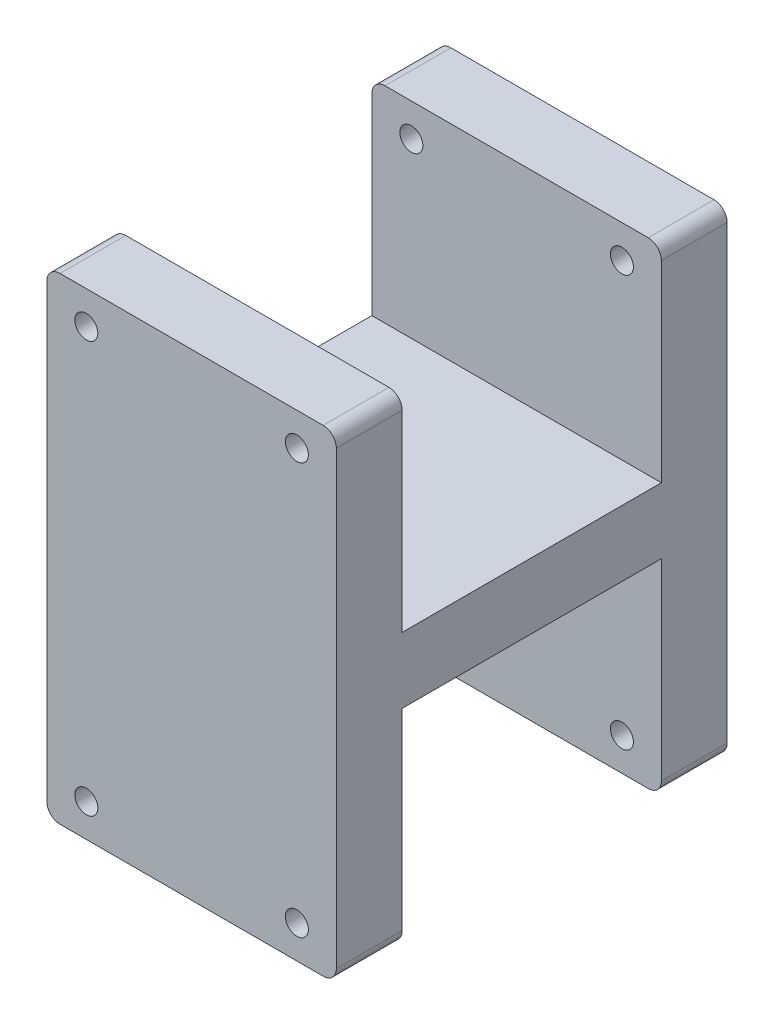
ISO-10303-21;
HEADER;
FILE_DESCRIPTION(('STEP AP214'),'2;1');
FILE_NAME('part.step','',(''),(''),'','','');
FILE_SCHEMA(('AUTOMOTIVE_DESIGN { 1 0 10303 214 1 1 1 1 }'));
ENDSEC;
DATA;
#1=APPLICATION_CONTEXT('core data for automotive mechanical design processes');
#2=APPLICATION_PROTOCOL_DEFINITION('international standard','automotive_design',2000,#1);
#3=PRODUCT_CONTEXT('',#1,'mechanical');
#4=PRODUCT('Part','Part','',(#3));
#5=PRODUCT_RELATED_PRODUCT_CATEGORY('part','',(#4));
#6=PRODUCT_DEFINITION_FORMATION('','',#4);
#7=PRODUCT_DEFINITION_CONTEXT('part definition',#1,'design');
#8=PRODUCT_DEFINITION('design','',#6,#7);
#9=PRODUCT_DEFINITION_SHAPE('','',#8);
#10=(LENGTH_UNIT() NAMED_UNIT(*) SI_UNIT(.MILLI.,.METRE.));
#11=(NAMED_UNIT(*) PLANE_ANGLE_UNIT() SI_UNIT($,.RADIAN.));
#12=(NAMED_UNIT(*) SI_UNIT($,.STERADIAN.) SOLID_ANGLE_UNIT());
#13=UNCERTAINTY_MEASURE_WITH_UNIT(LENGTH_MEASURE(1.E-05),#10,'distance_accuracy_value','');
#14=(GEOMETRIC_REPRESENTATION_CONTEXT(3) GLOBAL_UNCERTAINTY_ASSIGNED_CONTEXT((#13)) GLOBAL_UNIT_ASSIGNED_CONTEXT((#10,
#11,#12)) REPRESENTATION_CONTEXT('',''));
#15=CARTESIAN_POINT('',(0.,0.,0.));
#16=DIRECTION('',(0.,0.,1.));
#17=DIRECTION('',(1.,0.,0.));
#18=AXIS2_PLACEMENT_3D('',#15,#16,#17);
#19=CARTESIAN_POINT('',(-22.,-36.25,59.4));
#20=DIRECTION('',(1.,0.,0.));
#21=DIRECTION('',(0.,0.,-1.));
#22=AXIS2_PLACEMENT_3D('',#19,#20,#21);
#23=PLANE('',#22);
#24=DIRECTION('',(0.,-1.,0.));
#25=VECTOR('',#24,1.);
#26=CARTESIAN_POINT('',(-22.,-36.25,0.));
#27=LINE('',#26,#25);
#28=CARTESIAN_POINT('',(-22.,34.25,0.));
#29=VERTEX_POINT('',#28);
#30=CARTESIAN_POINT('',(-22.,-34.25,0.));
#31=VERTEX_POINT('',#30);
#32=EDGE_CURVE('E279',#29,#31,#27,.T.);
#33=ORIENTED_EDGE('',*,*,#32,.T.);
#34=DIRECTION('',(0.,0.,-1.));
#35=VECTOR('',#34,1.);
#36=CARTESIAN_POINT('',(-22.,-34.25,59.4));
#37=LINE('',#36,#35);
#38=CARTESIAN_POINT('',(-22.,-34.25,10.));
#39=VERTEX_POINT('',#38);
#40=EDGE_CURVE('E330',#31,#39,#37,.F.);
#41=ORIENTED_EDGE('',*,*,#40,.T.);
#42=DIRECTION('',(0.,-1.,0.));
#43=VECTOR('',#42,1.);
#44=CARTESIAN_POINT('',(-22.,0.,10.));
#45=LINE('',#44,#43);
#46=CARTESIAN_POINT('',(-22.,-5.,10.));
#47=VERTEX_POINT('',#46);
#48=EDGE_CURVE('E229',#47,#39,#45,.T.);
#49=ORIENTED_EDGE('',*,*,#48,.F.);
#50=DIRECTION('',(0.,0.,1.));
#51=VECTOR('',#50,1.);
#52=CARTESIAN_POINT('',(-22.,-5.,0.));
#53=LINE('',#52,#51);
#54=CARTESIAN_POINT('',(-22.,-5.00000000000001,49.4));
#55=VERTEX_POINT('',#54);
#56=EDGE_CURVE('E222',#47,#55,#53,.T.);
#57=ORIENTED_EDGE('',*,*,#56,.T.);
#58=DIRECTION('',(0.,-1.,0.));
#59=VECTOR('',#58,1.);
#60=CARTESIAN_POINT('',(-22.,0.,49.4));
#61=LINE('',#60,#59);
#62=CARTESIAN_POINT('',(-22.,-34.25,49.4));
#63=VERTEX_POINT('',#62);
#64=EDGE_CURVE('E225',#55,#63,#61,.T.);
#65=ORIENTED_EDGE('',*,*,#64,.T.);
#66=DIRECTION('',(0.,0.,-1.));
#67=VECTOR('',#66,1.);
#68=CARTESIAN_POINT('',(-22.,-34.25,59.4));
#69=LINE('',#68,#67);
#70=CARTESIAN_POINT('',(-22.,-34.25,59.4));
#71=VERTEX_POINT('',#70);
#72=EDGE_CURVE('E328',#63,#71,#69,.F.);
#73=ORIENTED_EDGE('',*,*,#72,.T.);
#74=DIRECTION('',(0.,-1.,0.));
#75=VECTOR('',#74,1.);
#76=CARTESIAN_POINT('',(-22.,-36.25,59.4));
#77=LINE('',#76,#75);
#78=CARTESIAN_POINT('',(-22.,34.25,59.4));
#79=VERTEX_POINT('',#78);
#80=EDGE_CURVE('E282',#79,#71,#77,.T.);
#81=ORIENTED_EDGE('',*,*,#80,.F.);
#82=DIRECTION('',(0.,0.,-1.));
#83=VECTOR('',#82,1.);
#84=CARTESIAN_POINT('',(-22.,34.25,59.4));
#85=LINE('',#84,#83);
#86=CARTESIAN_POINT('',(-22.,34.25,49.4));
#87=VERTEX_POINT('',#86);
#88=EDGE_CURVE('E326',#79,#87,#85,.T.);
#89=ORIENTED_EDGE('',*,*,#88,.T.);
#90=DIRECTION('',(0.,1.,0.));
#91=VECTOR('',#90,1.);
#92=CARTESIAN_POINT('',(-22.,0.,49.4));
#93=LINE('',#92,#91);
#94=CARTESIAN_POINT('',(-22.,4.99999999999999,49.4));
#95=VERTEX_POINT('',#94);
#96=EDGE_CURVE('E182',#95,#87,#93,.T.);
#97=ORIENTED_EDGE('',*,*,#96,.F.);
#98=DIRECTION('',(0.,0.,1.));
#99=VECTOR('',#98,1.);
#100=CARTESIAN_POINT('',(-22.,5.,0.));
#101=LINE('',#100,#99);
#102=CARTESIAN_POINT('',(-22.,5.,10.));
#103=VERTEX_POINT('',#102);
#104=EDGE_CURVE('E177',#103,#95,#101,.T.);
#105=ORIENTED_EDGE('',*,*,#104,.F.);
#106=DIRECTION('',(0.,1.,0.));
#107=VECTOR('',#106,1.);
#108=CARTESIAN_POINT('',(-22.,0.,10.));
#109=LINE('',#108,#107);
#110=CARTESIAN_POINT('',(-22.,34.25,10.));
#111=VERTEX_POINT('',#110);
#112=EDGE_CURVE('E185',#103,#111,#109,.T.);
#113=ORIENTED_EDGE('',*,*,#112,.T.);
#114=DIRECTION('',(0.,0.,-1.));
#115=VECTOR('',#114,1.);
#116=CARTESIAN_POINT('',(-22.,34.25,59.4));
#117=LINE('',#116,#115);
#118=EDGE_CURVE('E324',#111,#29,#117,.T.);
#119=ORIENTED_EDGE('',*,*,#118,.T.);
#120=EDGE_LOOP('',(#33,#41,#49,#57,#65,#73,#81,#89,#97,#105,#113,#119));
#121=FACE_BOUND('',#120,.T.);
#122=ADVANCED_FACE('F35',(#121),#23,.F.);
#123=CARTESIAN_POINT('',(22.,-36.25,59.4));
#124=DIRECTION('',(-1.,0.,0.));
#125=DIRECTION('',(0.,0.,1.));
#126=AXIS2_PLACEMENT_3D('',#123,#124,#125);
#127=PLANE('',#126);
#128=DIRECTION('',(0.,1.,0.));
#129=VECTOR('',#128,1.);
#130=CARTESIAN_POINT('',(22.,-36.25,0.));
#131=LINE('',#130,#129);
#132=CARTESIAN_POINT('',(22.,-34.25,0.));
#133=VERTEX_POINT('',#132);
#134=CARTESIAN_POINT('',(22.,34.25,0.));
#135=VERTEX_POINT('',#134);
#136=EDGE_CURVE('E300',#133,#135,#131,.T.);
#137=ORIENTED_EDGE('',*,*,#136,.T.);
#138=DIRECTION('',(0.,0.,-1.));
#139=VECTOR('',#138,1.);
#140=CARTESIAN_POINT('',(22.,34.25,59.4));
#141=LINE('',#140,#139);
#142=CARTESIAN_POINT('',(22.,34.25,10.));
#143=VERTEX_POINT('',#142);
#144=EDGE_CURVE('E11',#135,#143,#141,.F.);
#145=ORIENTED_EDGE('',*,*,#144,.T.);
#146=DIRECTION('',(0.,1.,0.));
#147=VECTOR('',#146,1.);
#148=CARTESIAN_POINT('',(22.,0.,10.));
#149=LINE('',#148,#147);
#150=CARTESIAN_POINT('',(22.,5.,10.));
#151=VERTEX_POINT('',#150);
#152=EDGE_CURVE('E201',#151,#143,#149,.T.);
#153=ORIENTED_EDGE('',*,*,#152,.F.);
#154=DIRECTION('',(0.,0.,1.));
#155=VECTOR('',#154,1.);
#156=CARTESIAN_POINT('',(22.,5.,0.));
#157=LINE('',#156,#155);
#158=CARTESIAN_POINT('',(22.,4.99999999999999,49.4));
#159=VERTEX_POINT('',#158);
#160=EDGE_CURVE('E180',#151,#159,#157,.T.);
#161=ORIENTED_EDGE('',*,*,#160,.T.);
#162=DIRECTION('',(0.,1.,0.));
#163=VECTOR('',#162,1.);
#164=CARTESIAN_POINT('',(22.,0.,49.4));
#165=LINE('',#164,#163);
#166=CARTESIAN_POINT('',(22.,34.25,49.4));
#167=VERTEX_POINT('',#166);
#168=EDGE_CURVE('E198',#159,#167,#165,.T.);
#169=ORIENTED_EDGE('',*,*,#168,.T.);
#170=DIRECTION('',(0.,0.,-1.));
#171=VECTOR('',#170,1.);
#172=CARTESIAN_POINT('',(22.,34.25,59.4));
#173=LINE('',#172,#171);
#174=CARTESIAN_POINT('',(22.,34.25,59.4));
#175=VERTEX_POINT('',#174);
#176=EDGE_CURVE('E43',#167,#175,#173,.F.);
#177=ORIENTED_EDGE('',*,*,#176,.T.);
#178=DIRECTION('',(0.,1.,0.));
#179=VECTOR('',#178,1.);
#180=CARTESIAN_POINT('',(22.,-36.25,59.4));
#181=LINE('',#180,#179);
#182=CARTESIAN_POINT('',(22.,-34.25,59.4));
#183=VERTEX_POINT('',#182);
#184=EDGE_CURVE('E289',#183,#175,#181,.T.);
#185=ORIENTED_EDGE('',*,*,#184,.F.);
#186=DIRECTION('',(0.,0.,-1.));
#187=VECTOR('',#186,1.);
#188=CARTESIAN_POINT('',(22.,-34.25,59.4));
#189=LINE('',#188,#187);
#190=CARTESIAN_POINT('',(22.,-34.25,49.4));
#191=VERTEX_POINT('',#190);
#192=EDGE_CURVE('E369',#183,#191,#189,.T.);
#193=ORIENTED_EDGE('',*,*,#192,.T.);
#194=DIRECTION('',(0.,-1.,0.));
#195=VECTOR('',#194,1.);
#196=CARTESIAN_POINT('',(22.,0.,49.4));
#197=LINE('',#196,#195);
#198=CARTESIAN_POINT('',(22.,-5.00000000000001,49.4));
#199=VERTEX_POINT('',#198);
#200=EDGE_CURVE('E234',#199,#191,#197,.T.);
#201=ORIENTED_EDGE('',*,*,#200,.F.);
#202=DIRECTION('',(0.,0.,1.));
#203=VECTOR('',#202,1.);
#204=CARTESIAN_POINT('',(22.,-5.,0.));
#205=LINE('',#204,#203);
#206=CARTESIAN_POINT('',(22.,-5.,10.));
#207=VERTEX_POINT('',#206);
#208=EDGE_CURVE('E221',#207,#199,#205,.T.);
#209=ORIENTED_EDGE('',*,*,#208,.F.);
#210=DIRECTION('',(0.,-1.,0.));
#211=VECTOR('',#210,1.);
#212=CARTESIAN_POINT('',(22.,0.,10.));
#213=LINE('',#212,#211);
#214=CARTESIAN_POINT('',(22.,-34.25,10.));
#215=VERTEX_POINT('',#214);
#216=EDGE_CURVE('E226',#207,#215,#213,.T.);
#217=ORIENTED_EDGE('',*,*,#216,.T.);
#218=DIRECTION('',(0.,0.,-1.));
#219=VECTOR('',#218,1.);
#220=CARTESIAN_POINT('',(22.,-34.25,59.4));
#221=LINE('',#220,#219);
#222=EDGE_CURVE('E372',#215,#133,#221,.T.);
#223=ORIENTED_EDGE('',*,*,#222,.T.);
#224=EDGE_LOOP('',(#137,#145,#153,#161,#169,#177,#185,#193,#201,#209,#217,#223));
#225=FACE_BOUND('',#224,.T.);
#226=ADVANCED_FACE('F376',(#225),#127,.F.);
#227=CARTESIAN_POINT('',(22.,36.25,59.4));
#228=DIRECTION('',(0.,-1.,0.));
#229=DIRECTION('',(0.,0.,-1.));
#230=AXIS2_PLACEMENT_3D('',#227,#228,#229);
#231=PLANE('',#230);
#232=DIRECTION('',(1.,0.,0.));
#233=VECTOR('',#232,1.);
#234=CARTESIAN_POINT('',(-22.,36.25,49.4));
#235=LINE('',#234,#233);
#236=CARTESIAN_POINT('',(-20.,36.25,49.4));
#237=VERTEX_POINT('',#236);
#238=CARTESIAN_POINT('',(20.,36.25,49.4));
#239=VERTEX_POINT('',#238);
#240=EDGE_CURVE('E210',#237,#239,#235,.T.);
#241=ORIENTED_EDGE('',*,*,#240,.F.);
#242=DIRECTION('',(0.,0.,-1.));
#243=VECTOR('',#242,1.);
#244=CARTESIAN_POINT('',(-20.,36.25,59.4));
#245=LINE('',#244,#243);
#246=CARTESIAN_POINT('',(-20.,36.25,59.4));
#247=VERTEX_POINT('',#246);
#248=EDGE_CURVE('E360',#237,#247,#245,.F.);
#249=ORIENTED_EDGE('',*,*,#248,.T.);
#250=DIRECTION('',(-1.,0.,0.));
#251=VECTOR('',#250,1.);
#252=CARTESIAN_POINT('',(22.,36.25,59.4));
#253=LINE('',#252,#251);
#254=CARTESIAN_POINT('',(20.,36.25,59.4));
#255=VERTEX_POINT('',#254);
#256=EDGE_CURVE('E292',#255,#247,#253,.T.);
#257=ORIENTED_EDGE('',*,*,#256,.F.);
#258=DIRECTION('',(0.,0.,-1.));
#259=VECTOR('',#258,1.);
#260=CARTESIAN_POINT('',(20.,36.25,59.4));
#261=LINE('',#260,#259);
#262=EDGE_CURVE('E357',#255,#239,#261,.T.);
#263=ORIENTED_EDGE('',*,*,#262,.T.);
#264=EDGE_LOOP('',(#241,#249,#257,#263));
#265=FACE_BOUND('',#264,.T.);
#266=ADVANCED_FACE('F388',(#265),#231,.F.);
#267=CARTESIAN_POINT('',(-16.,31.25,0.));
#268=DIRECTION('',(0.,0.,1.));
#269=DIRECTION('',(1.,0.,0.));
#270=AXIS2_PLACEMENT_3D('',#267,#268,#269);
#271=CYLINDRICAL_SURFACE('',#270,1.75);
#272=CARTESIAN_POINT('',(-16.,31.25,59.4));
#273=DIRECTION('',(0.,0.,1.));
#274=DIRECTION('',(1.,0.,0.));
#275=AXIS2_PLACEMENT_3D('',#272,#273,#274);
#276=CIRCLE('',#275,1.75);
#277=CARTESIAN_POINT('',(-14.25,31.25,59.4));
#278=VERTEX_POINT('',#277);
#279=EDGE_CURVE('E273',#278,#278,#276,.T.);
#280=ORIENTED_EDGE('',*,*,#279,.T.);
#281=EDGE_LOOP('',(#280));
#282=FACE_BOUND('',#281,.T.);
#283=CARTESIAN_POINT('',(-16.,31.25,49.4));
#284=DIRECTION('',(0.,0.,-1.));
#285=DIRECTION('',(0.,1.,0.));
#286=AXIS2_PLACEMENT_3D('',#283,#284,#285);
#287=CIRCLE('',#286,1.75);
#288=CARTESIAN_POINT('',(-16.,33.,49.4));
#289=VERTEX_POINT('',#288);
#290=EDGE_CURVE('E218',#289,#289,#287,.F.);
#291=ORIENTED_EDGE('',*,*,#290,.F.);
#292=EDGE_LOOP('',(#291));
#293=FACE_BOUND('',#292,.T.);
#294=ADVANCED_FACE('F581',(#282,#293),#271,.F.);
#295=CARTESIAN_POINT('',(16.,31.25,0.));
#296=DIRECTION('',(0.,0.,1.));
#297=DIRECTION('',(1.,0.,0.));
#298=AXIS2_PLACEMENT_3D('',#295,#296,#297);
#299=CYLINDRICAL_SURFACE('',#298,1.75);
#300=CARTESIAN_POINT('',(16.,31.25,59.4));
#301=DIRECTION('',(0.,0.,-1.));
#302=DIRECTION('',(-1.,0.,0.));
#303=AXIS2_PLACEMENT_3D('',#300,#301,#302);
#304=CIRCLE('',#303,1.75);
#305=CARTESIAN_POINT('',(14.25,31.25,59.4));
#306=VERTEX_POINT('',#305);
#307=EDGE_CURVE('E270',#306,#306,#304,.T.);
#308=ORIENTED_EDGE('',*,*,#307,.F.);
#309=EDGE_LOOP('',(#308));
#310=FACE_BOUND('',#309,.T.);
#311=CARTESIAN_POINT('',(16.,31.25,49.4));
#312=DIRECTION('',(0.,0.,-1.));
#313=DIRECTION('',(0.,1.,0.));
#314=AXIS2_PLACEMENT_3D('',#311,#312,#313);
#315=CIRCLE('',#314,1.75);
#316=CARTESIAN_POINT('',(16.,33.,49.4));
#317=VERTEX_POINT('',#316);
#318=EDGE_CURVE('E217',#317,#317,#315,.T.);
#319=ORIENTED_EDGE('',*,*,#318,.T.);
#320=EDGE_LOOP('',(#319));
#321=FACE_BOUND('',#320,.T.);
#322=ADVANCED_FACE('F590',(#310,#321),#299,.F.);
#323=CARTESIAN_POINT('',(22.,-36.25,59.4));
#324=DIRECTION('',(0.,1.,0.));
#325=DIRECTION('',(0.,0.,1.));
#326=AXIS2_PLACEMENT_3D('',#323,#324,#325);
#327=PLANE('',#326);
#328=DIRECTION('',(1.,0.,0.));
#329=VECTOR('',#328,1.);
#330=CARTESIAN_POINT('',(-22.,-36.25,10.));
#331=LINE('',#330,#329);
#332=CARTESIAN_POINT('',(-20.,-36.25,10.));
#333=VERTEX_POINT('',#332);
#334=CARTESIAN_POINT('',(20.,-36.25,10.));
#335=VERTEX_POINT('',#334);
#336=EDGE_CURVE('E242',#333,#335,#331,.T.);
#337=ORIENTED_EDGE('',*,*,#336,.F.);
#338=DIRECTION('',(0.,0.,-1.));
#339=VECTOR('',#338,1.);
#340=CARTESIAN_POINT('',(-20.,-36.25,59.4));
#341=LINE('',#340,#339);
#342=CARTESIAN_POINT('',(-20.,-36.25,0.));
#343=VERTEX_POINT('',#342);
#344=EDGE_CURVE('E313',#333,#343,#341,.T.);
#345=ORIENTED_EDGE('',*,*,#344,.T.);
#346=DIRECTION('',(1.,0.,0.));
#347=VECTOR('',#346,1.);
#348=CARTESIAN_POINT('',(22.,-36.25,0.));
#349=LINE('',#348,#347);
#350=CARTESIAN_POINT('',(20.,-36.25,0.));
#351=VERTEX_POINT('',#350);
#352=EDGE_CURVE('E297',#343,#351,#349,.T.);
#353=ORIENTED_EDGE('',*,*,#352,.T.);
#354=DIRECTION('',(0.,0.,-1.));
#355=VECTOR('',#354,1.);
#356=CARTESIAN_POINT('',(20.,-36.25,59.4));
#357=LINE('',#356,#355);
#358=EDGE_CURVE('E295',#351,#335,#357,.F.);
#359=ORIENTED_EDGE('',*,*,#358,.T.);
#360=EDGE_LOOP('',(#337,#345,#353,#359));
#361=FACE_BOUND('',#360,.T.);
#362=ADVANCED_FACE('F432',(#361),#327,.F.);
#363=CARTESIAN_POINT('',(16.,-31.25,0.));
#364=DIRECTION('',(0.,0.,1.));
#365=DIRECTION('',(1.,0.,0.));
#366=AXIS2_PLACEMENT_3D('',#363,#364,#365);
#367=CYLINDRICAL_SURFACE('',#366,1.75);
#368=CARTESIAN_POINT('',(16.,-31.25,0.));
#369=DIRECTION('',(0.,0.,1.));
#370=DIRECTION('',(1.,0.,0.));
#371=AXIS2_PLACEMENT_3D('',#368,#369,#370);
#372=CIRCLE('',#371,1.75);
#373=CARTESIAN_POINT('',(17.75,-31.25,0.));
#374=VERTEX_POINT('',#373);
#375=EDGE_CURVE('E261',#374,#374,#372,.T.);
#376=ORIENTED_EDGE('',*,*,#375,.F.);
#377=EDGE_LOOP('',(#376));
#378=FACE_BOUND('',#377,.T.);
#379=CARTESIAN_POINT('',(16.,-31.25,10.));
#380=DIRECTION('',(0.,0.,1.));
#381=DIRECTION('',(0.,-1.,0.));
#382=AXIS2_PLACEMENT_3D('',#379,#380,#381);
#383=CIRCLE('',#382,1.75);
#384=CARTESIAN_POINT('',(16.,-33.,10.));
#385=VERTEX_POINT('',#384);
#386=EDGE_CURVE('E254',#385,#385,#383,.F.);
#387=ORIENTED_EDGE('',*,*,#386,.F.);
#388=EDGE_LOOP('',(#387));
#389=FACE_BOUND('',#388,.T.);
#390=ADVANCED_FACE('F609',(#378,#389),#367,.F.);
#391=CARTESIAN_POINT('',(-16.,-31.25,0.));
#392=DIRECTION('',(0.,0.,1.));
#393=DIRECTION('',(1.,0.,0.));
#394=AXIS2_PLACEMENT_3D('',#391,#392,#393);
#395=CYLINDRICAL_SURFACE('',#394,1.75);
#396=CARTESIAN_POINT('',(-16.,-31.25,0.));
#397=DIRECTION('',(0.,0.,-1.));
#398=DIRECTION('',(-1.,0.,0.));
#399=AXIS2_PLACEMENT_3D('',#396,#397,#398);
#400=CIRCLE('',#399,1.75);
#401=CARTESIAN_POINT('',(-17.75,-31.25,0.));
#402=VERTEX_POINT('',#401);
#403=EDGE_CURVE('E257',#402,#402,#400,.T.);
#404=ORIENTED_EDGE('',*,*,#403,.T.);
#405=EDGE_LOOP('',(#404));
#406=FACE_BOUND('',#405,.T.);
#407=CARTESIAN_POINT('',(-16.,-31.25,10.));
#408=DIRECTION('',(0.,0.,1.));
#409=DIRECTION('',(0.,-1.,0.));
#410=AXIS2_PLACEMENT_3D('',#407,#408,#409);
#411=CIRCLE('',#410,1.75);
#412=CARTESIAN_POINT('',(-16.,-33.,10.));
#413=VERTEX_POINT('',#412);
#414=EDGE_CURVE('E253',#413,#413,#411,.T.);
#415=ORIENTED_EDGE('',*,*,#414,.T.);
#416=EDGE_LOOP('',(#415));
#417=FACE_BOUND('',#416,.T.);
#418=ADVANCED_FACE('F616',(#406,#417),#395,.F.);
#419=DIRECTION('',(1.,0.,0.));
#420=VECTOR('',#419,1.);
#421=CARTESIAN_POINT('',(22.,-36.25,59.4));
#422=LINE('',#421,#420);
#423=CARTESIAN_POINT('',(-20.,-36.25,59.4));
#424=VERTEX_POINT('',#423);
#425=CARTESIAN_POINT('',(20.,-36.25,59.4));
#426=VERTEX_POINT('',#425);
#427=EDGE_CURVE('E285',#424,#426,#422,.T.);
#428=ORIENTED_EDGE('',*,*,#427,.F.);
#429=DIRECTION('',(0.,0.,-1.));
#430=VECTOR('',#429,1.);
#431=CARTESIAN_POINT('',(-20.,-36.25,59.4));
#432=LINE('',#431,#430);
#433=CARTESIAN_POINT('',(-20.,-36.25,49.4));
#434=VERTEX_POINT('',#433);
#435=EDGE_CURVE('E338',#424,#434,#432,.T.);
#436=ORIENTED_EDGE('',*,*,#435,.T.);
#437=DIRECTION('',(1.,0.,0.));
#438=VECTOR('',#437,1.);
#439=CARTESIAN_POINT('',(-22.,-36.25,49.4));
#440=LINE('',#439,#438);
#441=CARTESIAN_POINT('',(20.,-36.25,49.4));
#442=VERTEX_POINT('',#441);
#443=EDGE_CURVE('E245',#434,#442,#440,.T.);
#444=ORIENTED_EDGE('',*,*,#443,.T.);
#445=DIRECTION('',(0.,0.,-1.));
#446=VECTOR('',#445,1.);
#447=CARTESIAN_POINT('',(20.,-36.25,59.4));
#448=LINE('',#447,#446);
#449=EDGE_CURVE('E336',#442,#426,#448,.F.);
#450=ORIENTED_EDGE('',*,*,#449,.T.);
#451=EDGE_LOOP('',(#428,#436,#444,#450));
#452=FACE_BOUND('',#451,.T.);
#453=ADVANCED_FACE('F406',(#452),#327,.F.);
#454=DIRECTION('',(-1.,0.,0.));
#455=VECTOR('',#454,1.);
#456=CARTESIAN_POINT('',(22.,36.25,0.));
#457=LINE('',#456,#455);
#458=CARTESIAN_POINT('',(20.,36.25,0.));
#459=VERTEX_POINT('',#458);
#460=CARTESIAN_POINT('',(-20.,36.25,0.));
#461=VERTEX_POINT('',#460);
#462=EDGE_CURVE('E286',#459,#461,#457,.T.);
#463=ORIENTED_EDGE('',*,*,#462,.T.);
#464=DIRECTION('',(0.,0.,-1.));
#465=VECTOR('',#464,1.);
#466=CARTESIAN_POINT('',(-20.,36.25,59.4));
#467=LINE('',#466,#465);
#468=CARTESIAN_POINT('',(-20.,36.25,10.));
#469=VERTEX_POINT('',#468);
#470=EDGE_CURVE('E365',#461,#469,#467,.F.);
#471=ORIENTED_EDGE('',*,*,#470,.T.);
#472=DIRECTION('',(1.,0.,0.));
#473=VECTOR('',#472,1.);
#474=CARTESIAN_POINT('',(-22.,36.25,10.));
#475=LINE('',#474,#473);
#476=CARTESIAN_POINT('',(20.,36.25,10.));
#477=VERTEX_POINT('',#476);
#478=EDGE_CURVE('E181',#469,#477,#475,.T.);
#479=ORIENTED_EDGE('',*,*,#478,.T.);
#480=DIRECTION('',(0.,0.,-1.));
#481=VECTOR('',#480,1.);
#482=CARTESIAN_POINT('',(20.,36.25,59.4));
#483=LINE('',#482,#481);
#484=EDGE_CURVE('E362',#477,#459,#483,.T.);
#485=ORIENTED_EDGE('',*,*,#484,.T.);
#486=EDGE_LOOP('',(#463,#471,#479,#485));
#487=FACE_BOUND('',#486,.T.);
#488=ADVANCED_FACE('F446',(#487),#231,.F.);
#489=CARTESIAN_POINT('',(0.,0.,59.4));
#490=DIRECTION('',(0.,0.,1.));
#491=DIRECTION('',(1.,0.,0.));
#492=AXIS2_PLACEMENT_3D('',#489,#490,#491);
#493=PLANE('',#492);
#494=CARTESIAN_POINT('',(-16.,-31.25,59.4));
#495=DIRECTION('',(0.,0.,-1.));
#496=DIRECTION('',(-1.,0.,0.));
#497=AXIS2_PLACEMENT_3D('',#494,#495,#496);
#498=CIRCLE('',#497,1.75);
#499=CARTESIAN_POINT('',(-17.75,-31.25,59.4));
#500=VERTEX_POINT('',#499);
#501=EDGE_CURVE('E258',#500,#500,#498,.T.);
#502=ORIENTED_EDGE('',*,*,#501,.T.);
#503=EDGE_LOOP('',(#502));
#504=FACE_BOUND('',#503,.T.);
#505=CARTESIAN_POINT('',(16.,-31.25,59.4));
#506=DIRECTION('',(0.,0.,1.));
#507=DIRECTION('',(1.,0.,0.));
#508=AXIS2_PLACEMENT_3D('',#505,#506,#507);
#509=CIRCLE('',#508,1.75);
#510=CARTESIAN_POINT('',(17.75,-31.25,59.4));
#511=VERTEX_POINT('',#510);
#512=EDGE_CURVE('E264',#511,#511,#509,.T.);
#513=ORIENTED_EDGE('',*,*,#512,.F.);
#514=EDGE_LOOP('',(#513));
#515=FACE_BOUND('',#514,.T.);
#516=ORIENTED_EDGE('',*,*,#307,.T.);
#517=EDGE_LOOP('',(#516));
#518=FACE_BOUND('',#517,.T.);
#519=ORIENTED_EDGE('',*,*,#279,.F.);
#520=EDGE_LOOP('',(#519));
#521=FACE_BOUND('',#520,.T.);
#522=ORIENTED_EDGE('',*,*,#80,.T.);
#523=CARTESIAN_POINT('',(-20.,-34.25,59.4));
#524=DIRECTION('',(0.,0.,1.));
#525=DIRECTION('',(1.,0.,0.));
#526=AXIS2_PLACEMENT_3D('',#523,#524,#525);
#527=CIRCLE('',#526,2.);
#528=EDGE_CURVE('E351',#71,#424,#527,.T.);
#529=ORIENTED_EDGE('',*,*,#528,.T.);
#530=ORIENTED_EDGE('',*,*,#427,.T.);
#531=CARTESIAN_POINT('',(20.,-34.25,59.4));
#532=DIRECTION('',(0.,0.,1.));
#533=DIRECTION('',(1.,0.,0.));
#534=AXIS2_PLACEMENT_3D('',#531,#532,#533);
#535=CIRCLE('',#534,2.);
#536=EDGE_CURVE('E345',#426,#183,#535,.T.);
#537=ORIENTED_EDGE('',*,*,#536,.T.);
#538=ORIENTED_EDGE('',*,*,#184,.T.);
#539=CARTESIAN_POINT('',(20.,34.25,59.4));
#540=DIRECTION('',(0.,0.,1.));
#541=DIRECTION('',(1.,0.,0.));
#542=AXIS2_PLACEMENT_3D('',#539,#540,#541);
#543=CIRCLE('',#542,2.);
#544=EDGE_CURVE('E347',#175,#255,#543,.T.);
#545=ORIENTED_EDGE('',*,*,#544,.T.);
#546=ORIENTED_EDGE('',*,*,#256,.T.);
#547=CARTESIAN_POINT('',(-20.,34.25,59.4));
#548=DIRECTION('',(0.,0.,1.));
#549=DIRECTION('',(1.,0.,0.));
#550=AXIS2_PLACEMENT_3D('',#547,#548,#549);
#551=CIRCLE('',#550,2.);
#552=EDGE_CURVE('E349',#247,#79,#551,.T.);
#553=ORIENTED_EDGE('',*,*,#552,.T.);
#554=EDGE_LOOP('',(#522,#529,#530,#537,#538,#545,#546,#553));
#555=FACE_BOUND('',#554,.T.);
#556=ADVANCED_FACE('F381',(#504,#515,#518,#521,#555),#493,.T.);
#557=CARTESIAN_POINT('',(0.,0.,0.));
#558=DIRECTION('',(0.,0.,1.));
#559=DIRECTION('',(1.,0.,0.));
#560=AXIS2_PLACEMENT_3D('',#557,#558,#559);
#561=PLANE('',#560);
#562=ORIENTED_EDGE('',*,*,#403,.F.);
#563=EDGE_LOOP('',(#562));
#564=FACE_BOUND('',#563,.T.);
#565=ORIENTED_EDGE('',*,*,#375,.T.);
#566=EDGE_LOOP('',(#565));
#567=FACE_BOUND('',#566,.T.);
#568=CARTESIAN_POINT('',(16.,31.25,0.));
#569=DIRECTION('',(0.,0.,-1.));
#570=DIRECTION('',(-1.,0.,0.));
#571=AXIS2_PLACEMENT_3D('',#568,#569,#570);
#572=CIRCLE('',#571,1.75);
#573=CARTESIAN_POINT('',(14.25,31.25,0.));
#574=VERTEX_POINT('',#573);
#575=EDGE_CURVE('E267',#574,#574,#572,.T.);
#576=ORIENTED_EDGE('',*,*,#575,.F.);
#577=EDGE_LOOP('',(#576));
#578=FACE_BOUND('',#577,.T.);
#579=CARTESIAN_POINT('',(-16.,31.25,0.));
#580=DIRECTION('',(0.,0.,1.));
#581=DIRECTION('',(1.,0.,0.));
#582=AXIS2_PLACEMENT_3D('',#579,#580,#581);
#583=CIRCLE('',#582,1.75);
#584=CARTESIAN_POINT('',(-14.25,31.25,0.));
#585=VERTEX_POINT('',#584);
#586=EDGE_CURVE('E276',#585,#585,#583,.T.);
#587=ORIENTED_EDGE('',*,*,#586,.T.);
#588=EDGE_LOOP('',(#587));
#589=FACE_BOUND('',#588,.T.);
#590=ORIENTED_EDGE('',*,*,#352,.F.);
#591=CARTESIAN_POINT('',(-20.,-34.25,0.));
#592=DIRECTION('',(0.,0.,1.));
#593=DIRECTION('',(1.,0.,0.));
#594=AXIS2_PLACEMENT_3D('',#591,#592,#593);
#595=CIRCLE('',#594,2.);
#596=EDGE_CURVE('E322',#343,#31,#595,.F.);
#597=ORIENTED_EDGE('',*,*,#596,.T.);
#598=ORIENTED_EDGE('',*,*,#32,.F.);
#599=CARTESIAN_POINT('',(-20.,34.25,0.));
#600=DIRECTION('',(0.,0.,1.));
#601=DIRECTION('',(1.,0.,0.));
#602=AXIS2_PLACEMENT_3D('',#599,#600,#601);
#603=CIRCLE('',#602,2.);
#604=EDGE_CURVE('E320',#29,#461,#603,.F.);
#605=ORIENTED_EDGE('',*,*,#604,.T.);
#606=ORIENTED_EDGE('',*,*,#462,.F.);
#607=CARTESIAN_POINT('',(20.,34.25,0.));
#608=DIRECTION('',(0.,0.,1.));
#609=DIRECTION('',(1.,0.,0.));
#610=AXIS2_PLACEMENT_3D('',#607,#608,#609);
#611=CIRCLE('',#610,2.);
#612=EDGE_CURVE('E318',#459,#135,#611,.F.);
#613=ORIENTED_EDGE('',*,*,#612,.T.);
#614=ORIENTED_EDGE('',*,*,#136,.F.);
#615=CARTESIAN_POINT('',(20.,-34.25,0.));
#616=DIRECTION('',(0.,0.,1.));
#617=DIRECTION('',(1.,0.,0.));
#618=AXIS2_PLACEMENT_3D('',#615,#616,#617);
#619=CIRCLE('',#618,2.);
#620=EDGE_CURVE('E316',#133,#351,#619,.F.);
#621=ORIENTED_EDGE('',*,*,#620,.T.);
#622=EDGE_LOOP('',(#590,#597,#598,#605,#606,#613,#614,#621));
#623=FACE_BOUND('',#622,.T.);
#624=ADVANCED_FACE('F435',(#564,#567,#578,#589,#623),#561,.F.);
#625=CARTESIAN_POINT('',(-16.,31.25,10.));
#626=DIRECTION('',(0.,0.,-1.));
#627=DIRECTION('',(0.,1.,0.));
#628=AXIS2_PLACEMENT_3D('',#625,#626,#627);
#629=CIRCLE('',#628,1.75);
#630=CARTESIAN_POINT('',(-16.,33.,10.));
#631=VERTEX_POINT('',#630);
#632=EDGE_CURVE('E214',#631,#631,#629,.F.);
#633=ORIENTED_EDGE('',*,*,#632,.T.);
#634=EDGE_LOOP('',(#633));
#635=FACE_BOUND('',#634,.T.);
#636=ORIENTED_EDGE('',*,*,#586,.F.);
#637=EDGE_LOOP('',(#636));
#638=FACE_BOUND('',#637,.T.);
#639=ADVANCED_FACE('F593',(#635,#638),#271,.F.);
#640=CARTESIAN_POINT('',(16.,31.25,10.));
#641=DIRECTION('',(0.,0.,-1.));
#642=DIRECTION('',(0.,1.,0.));
#643=AXIS2_PLACEMENT_3D('',#640,#641,#642);
#644=CIRCLE('',#643,1.75);
#645=CARTESIAN_POINT('',(16.,33.,10.));
#646=VERTEX_POINT('',#645);
#647=EDGE_CURVE('E209',#646,#646,#644,.T.);
#648=ORIENTED_EDGE('',*,*,#647,.F.);
#649=EDGE_LOOP('',(#648));
#650=FACE_BOUND('',#649,.T.);
#651=ORIENTED_EDGE('',*,*,#575,.T.);
#652=EDGE_LOOP('',(#651));
#653=FACE_BOUND('',#652,.T.);
#654=ADVANCED_FACE('F602',(#650,#653),#299,.F.);
#655=CARTESIAN_POINT('',(16.,-31.25,49.4));
#656=DIRECTION('',(0.,0.,1.));
#657=DIRECTION('',(1.,0.,0.));
#658=AXIS2_PLACEMENT_3D('',#655,#656,#657);
#659=CIRCLE('',#658,1.75);
#660=CARTESIAN_POINT('',(17.75,-31.25,49.4));
#661=VERTEX_POINT('',#660);
#662=EDGE_CURVE('E250',#661,#661,#659,.F.);
#663=ORIENTED_EDGE('',*,*,#662,.T.);
#664=EDGE_LOOP('',(#663));
#665=FACE_BOUND('',#664,.T.);
#666=ORIENTED_EDGE('',*,*,#512,.T.);
#667=EDGE_LOOP('',(#666));
#668=FACE_BOUND('',#667,.T.);
#669=ADVANCED_FACE('F619',(#665,#668),#367,.F.);
#670=CARTESIAN_POINT('',(-16.,-31.25,49.4));
#671=DIRECTION('',(0.,0.,1.));
#672=DIRECTION('',(1.,0.,0.));
#673=AXIS2_PLACEMENT_3D('',#670,#671,#672);
#674=CIRCLE('',#673,1.75);
#675=CARTESIAN_POINT('',(-14.25,-31.25,49.4));
#676=VERTEX_POINT('',#675);
#677=EDGE_CURVE('E241',#676,#676,#674,.T.);
#678=ORIENTED_EDGE('',*,*,#677,.F.);
#679=EDGE_LOOP('',(#678));
#680=FACE_BOUND('',#679,.T.);
#681=ORIENTED_EDGE('',*,*,#501,.F.);
#682=EDGE_LOOP('',(#681));
#683=FACE_BOUND('',#682,.T.);
#684=ADVANCED_FACE('F562',(#680,#683),#395,.F.);
#685=CARTESIAN_POINT('',(-22.,0.,10.));
#686=DIRECTION('',(0.,0.,1.));
#687=DIRECTION('',(0.,-1.,0.));
#688=AXIS2_PLACEMENT_3D('',#685,#686,#687);
#689=PLANE('',#688);
#690=ORIENTED_EDGE('',*,*,#414,.F.);
#691=EDGE_LOOP('',(#690));
#692=FACE_BOUND('',#691,.T.);
#693=ORIENTED_EDGE('',*,*,#48,.T.);
#694=CARTESIAN_POINT('',(-20.,-34.25,9.99999999999999));
#695=DIRECTION('',(0.,0.,1.));
#696=DIRECTION('',(0.,-1.,0.));
#697=AXIS2_PLACEMENT_3D('',#694,#695,#696);
#698=CIRCLE('',#697,2.);
#699=EDGE_CURVE('E334',#39,#333,#698,.T.);
#700=ORIENTED_EDGE('',*,*,#699,.T.);
#701=ORIENTED_EDGE('',*,*,#336,.T.);
#702=CARTESIAN_POINT('',(20.,-34.25,9.99999999999999));
#703=DIRECTION('',(0.,0.,1.));
#704=DIRECTION('',(0.,-1.,0.));
#705=AXIS2_PLACEMENT_3D('',#702,#703,#704);
#706=CIRCLE('',#705,2.);
#707=EDGE_CURVE('E332',#335,#215,#706,.T.);
#708=ORIENTED_EDGE('',*,*,#707,.T.);
#709=ORIENTED_EDGE('',*,*,#216,.F.);
#710=DIRECTION('',(1.,0.,0.));
#711=VECTOR('',#710,1.);
#712=CARTESIAN_POINT('',(-22.,-5.,10.));
#713=LINE('',#712,#711);
#714=EDGE_CURVE('E239',#47,#207,#713,.T.);
#715=ORIENTED_EDGE('',*,*,#714,.F.);
#716=EDGE_LOOP('',(#693,#700,#701,#708,#709,#715));
#717=FACE_BOUND('',#716,.T.);
#718=ORIENTED_EDGE('',*,*,#386,.T.);
#719=EDGE_LOOP('',(#718));
#720=FACE_BOUND('',#719,.T.);
#721=ADVANCED_FACE('F424',(#692,#717,#720),#689,.T.);
#722=CARTESIAN_POINT('',(-22.,0.,49.4));
#723=DIRECTION('',(0.,0.,1.));
#724=DIRECTION('',(1.,0.,0.));
#725=AXIS2_PLACEMENT_3D('',#722,#723,#724);
#726=PLANE('',#725);
#727=ORIENTED_EDGE('',*,*,#443,.F.);
#728=CARTESIAN_POINT('',(-20.,-34.25,49.4));
#729=DIRECTION('',(0.,0.,1.));
#730=DIRECTION('',(1.,0.,0.));
#731=AXIS2_PLACEMENT_3D('',#728,#729,#730);
#732=CIRCLE('',#731,2.);
#733=EDGE_CURVE('E343',#434,#63,#732,.F.);
#734=ORIENTED_EDGE('',*,*,#733,.T.);
#735=ORIENTED_EDGE('',*,*,#64,.F.);
#736=DIRECTION('',(1.,0.,0.));
#737=VECTOR('',#736,1.);
#738=CARTESIAN_POINT('',(-22.,-5.00000000000001,49.4));
#739=LINE('',#738,#737);
#740=EDGE_CURVE('E232',#55,#199,#739,.T.);
#741=ORIENTED_EDGE('',*,*,#740,.T.);
#742=ORIENTED_EDGE('',*,*,#200,.T.);
#743=CARTESIAN_POINT('',(20.,-34.25,49.4));
#744=DIRECTION('',(0.,0.,1.));
#745=DIRECTION('',(1.,0.,0.));
#746=AXIS2_PLACEMENT_3D('',#743,#744,#745);
#747=CIRCLE('',#746,2.);
#748=EDGE_CURVE('E341',#191,#442,#747,.F.);
#749=ORIENTED_EDGE('',*,*,#748,.T.);
#750=EDGE_LOOP('',(#727,#734,#735,#741,#742,#749));
#751=FACE_BOUND('',#750,.T.);
#752=ORIENTED_EDGE('',*,*,#677,.T.);
#753=EDGE_LOOP('',(#752));
#754=FACE_BOUND('',#753,.T.);
#755=ORIENTED_EDGE('',*,*,#662,.F.);
#756=EDGE_LOOP('',(#755));
#757=FACE_BOUND('',#756,.T.);
#758=ADVANCED_FACE('F409',(#751,#754,#757),#726,.F.);
#759=CARTESIAN_POINT('',(-22.,-5.,0.));
#760=DIRECTION('',(0.,1.,0.));
#761=DIRECTION('',(0.,0.,1.));
#762=AXIS2_PLACEMENT_3D('',#759,#760,#761);
#763=PLANE('',#762);
#764=ORIENTED_EDGE('',*,*,#208,.T.);
#765=ORIENTED_EDGE('',*,*,#740,.F.);
#766=ORIENTED_EDGE('',*,*,#56,.F.);
#767=ORIENTED_EDGE('',*,*,#714,.T.);
#768=EDGE_LOOP('',(#764,#765,#766,#767));
#769=FACE_BOUND('',#768,.T.);
#770=ADVANCED_FACE('F418',(#769),#763,.F.);
#771=CARTESIAN_POINT('',(-22.,0.,49.4));
#772=DIRECTION('',(0.,0.,-1.));
#773=DIRECTION('',(0.,1.,0.));
#774=AXIS2_PLACEMENT_3D('',#771,#772,#773);
#775=PLANE('',#774);
#776=ORIENTED_EDGE('',*,*,#318,.F.);
#777=EDGE_LOOP('',(#776));
#778=FACE_BOUND('',#777,.T.);
#779=ORIENTED_EDGE('',*,*,#96,.T.);
#780=CARTESIAN_POINT('',(-20.,34.25,49.4));
#781=DIRECTION('',(0.,0.,-1.));
#782=DIRECTION('',(0.,1.,0.));
#783=AXIS2_PLACEMENT_3D('',#780,#781,#782);
#784=CIRCLE('',#783,2.);
#785=EDGE_CURVE('E355',#87,#237,#784,.T.);
#786=ORIENTED_EDGE('',*,*,#785,.T.);
#787=ORIENTED_EDGE('',*,*,#240,.T.);
#788=CARTESIAN_POINT('',(20.,34.25,49.4));
#789=DIRECTION('',(0.,0.,-1.));
#790=DIRECTION('',(0.,1.,0.));
#791=AXIS2_PLACEMENT_3D('',#788,#789,#790);
#792=CIRCLE('',#791,2.);
#793=EDGE_CURVE('E353',#239,#167,#792,.T.);
#794=ORIENTED_EDGE('',*,*,#793,.T.);
#795=ORIENTED_EDGE('',*,*,#168,.F.);
#796=DIRECTION('',(1.,0.,0.));
#797=VECTOR('',#796,1.);
#798=CARTESIAN_POINT('',(-22.,4.99999999999999,49.4));
#799=LINE('',#798,#797);
#800=EDGE_CURVE('E207',#95,#159,#799,.T.);
#801=ORIENTED_EDGE('',*,*,#800,.F.);
#802=EDGE_LOOP('',(#779,#786,#787,#794,#795,#801));
#803=FACE_BOUND('',#802,.T.);
#804=ORIENTED_EDGE('',*,*,#290,.T.);
#805=EDGE_LOOP('',(#804));
#806=FACE_BOUND('',#805,.T.);
#807=ADVANCED_FACE('F391',(#778,#803,#806),#775,.T.);
#808=CARTESIAN_POINT('',(-22.,0.,10.));
#809=DIRECTION('',(0.,0.,-1.));
#810=DIRECTION('',(0.,1.,0.));
#811=AXIS2_PLACEMENT_3D('',#808,#809,#810);
#812=PLANE('',#811);
#813=ORIENTED_EDGE('',*,*,#478,.F.);
#814=CARTESIAN_POINT('',(-20.,34.25,9.99999999999999));
#815=DIRECTION('',(0.,0.,-1.));
#816=DIRECTION('',(0.,1.,0.));
#817=AXIS2_PLACEMENT_3D('',#814,#815,#816);
#818=CIRCLE('',#817,2.);
#819=EDGE_CURVE('E189',#469,#111,#818,.F.);
#820=ORIENTED_EDGE('',*,*,#819,.T.);
#821=ORIENTED_EDGE('',*,*,#112,.F.);
#822=DIRECTION('',(1.,0.,0.));
#823=VECTOR('',#822,1.);
#824=CARTESIAN_POINT('',(-22.,5.,10.));
#825=LINE('',#824,#823);
#826=EDGE_CURVE('E172',#103,#151,#825,.T.);
#827=ORIENTED_EDGE('',*,*,#826,.T.);
#828=ORIENTED_EDGE('',*,*,#152,.T.);
#829=CARTESIAN_POINT('',(20.,34.25,9.99999999999999));
#830=DIRECTION('',(0.,0.,-1.));
#831=DIRECTION('',(0.,1.,0.));
#832=AXIS2_PLACEMENT_3D('',#829,#830,#831);
#833=CIRCLE('',#832,2.);
#834=EDGE_CURVE('E55',#143,#477,#833,.F.);
#835=ORIENTED_EDGE('',*,*,#834,.T.);
#836=EDGE_LOOP('',(#813,#820,#821,#827,#828,#835));
#837=FACE_BOUND('',#836,.T.);
#838=ORIENTED_EDGE('',*,*,#647,.T.);
#839=EDGE_LOOP('',(#838));
#840=FACE_BOUND('',#839,.T.);
#841=ORIENTED_EDGE('',*,*,#632,.F.);
#842=EDGE_LOOP('',(#841));
#843=FACE_BOUND('',#842,.T.);
#844=ADVANCED_FACE('F186',(#837,#840,#843),#812,.F.);
#845=CARTESIAN_POINT('',(-22.,5.,0.));
#846=DIRECTION('',(0.,1.,0.));
#847=DIRECTION('',(0.,0.,1.));
#848=AXIS2_PLACEMENT_3D('',#845,#846,#847);
#849=PLANE('',#848);
#850=ORIENTED_EDGE('',*,*,#160,.F.);
#851=ORIENTED_EDGE('',*,*,#826,.F.);
#852=ORIENTED_EDGE('',*,*,#104,.T.);
#853=ORIENTED_EDGE('',*,*,#800,.T.);
#854=EDGE_LOOP('',(#850,#851,#852,#853));
#855=FACE_BOUND('',#854,.T.);
#856=ADVANCED_FACE('F174',(#855),#849,.T.);
#857=CARTESIAN_POINT('',(-20.,-34.25,59.4));
#858=DIRECTION('',(0.,0.,-1.));
#859=DIRECTION('',(-1.,0.,0.));
#860=AXIS2_PLACEMENT_3D('',#857,#858,#859);
#861=CYLINDRICAL_SURFACE('',#860,2.);
#862=ORIENTED_EDGE('',*,*,#699,.F.);
#863=ORIENTED_EDGE('',*,*,#40,.F.);
#864=ORIENTED_EDGE('',*,*,#596,.F.);
#865=ORIENTED_EDGE('',*,*,#344,.F.);
#866=EDGE_LOOP('',(#862,#863,#864,#865));
#867=FACE_BOUND('',#866,.T.);
#868=ADVANCED_FACE('F429',(#867),#861,.T.);
#869=CARTESIAN_POINT('',(-20.,-34.25,59.4));
#870=DIRECTION('',(0.,0.,-1.));
#871=DIRECTION('',(-1.,0.,0.));
#872=AXIS2_PLACEMENT_3D('',#869,#870,#871);
#873=CYLINDRICAL_SURFACE('',#872,2.);
#874=ORIENTED_EDGE('',*,*,#528,.F.);
#875=ORIENTED_EDGE('',*,*,#72,.F.);
#876=ORIENTED_EDGE('',*,*,#733,.F.);
#877=ORIENTED_EDGE('',*,*,#435,.F.);
#878=EDGE_LOOP('',(#874,#875,#876,#877));
#879=FACE_BOUND('',#878,.T.);
#880=ADVANCED_FACE('F403',(#879),#873,.T.);
#881=CARTESIAN_POINT('',(-20.,34.25,59.4));
#882=DIRECTION('',(0.,0.,-1.));
#883=DIRECTION('',(-1.,0.,0.));
#884=AXIS2_PLACEMENT_3D('',#881,#882,#883);
#885=CYLINDRICAL_SURFACE('',#884,2.);
#886=ORIENTED_EDGE('',*,*,#552,.F.);
#887=ORIENTED_EDGE('',*,*,#248,.F.);
#888=ORIENTED_EDGE('',*,*,#785,.F.);
#889=ORIENTED_EDGE('',*,*,#88,.F.);
#890=EDGE_LOOP('',(#886,#887,#888,#889));
#891=FACE_BOUND('',#890,.T.);
#892=ADVANCED_FACE('F396',(#891),#885,.T.);
#893=CARTESIAN_POINT('',(-20.,34.25,59.4));
#894=DIRECTION('',(0.,0.,-1.));
#895=DIRECTION('',(-1.,0.,0.));
#896=AXIS2_PLACEMENT_3D('',#893,#894,#895);
#897=CYLINDRICAL_SURFACE('',#896,2.);
#898=ORIENTED_EDGE('',*,*,#819,.F.);
#899=ORIENTED_EDGE('',*,*,#470,.F.);
#900=ORIENTED_EDGE('',*,*,#604,.F.);
#901=ORIENTED_EDGE('',*,*,#118,.F.);
#902=EDGE_LOOP('',(#898,#899,#900,#901));
#903=FACE_BOUND('',#902,.T.);
#904=ADVANCED_FACE('F449',(#903),#897,.T.);
#905=CARTESIAN_POINT('',(20.,34.25,59.4));
#906=DIRECTION('',(0.,0.,-1.));
#907=DIRECTION('',(-1.,0.,0.));
#908=AXIS2_PLACEMENT_3D('',#905,#906,#907);
#909=CYLINDRICAL_SURFACE('',#908,2.);
#910=ORIENTED_EDGE('',*,*,#834,.F.);
#911=ORIENTED_EDGE('',*,*,#144,.F.);
#912=ORIENTED_EDGE('',*,*,#612,.F.);
#913=ORIENTED_EDGE('',*,*,#484,.F.);
#914=EDGE_LOOP('',(#910,#911,#912,#913));
#915=FACE_BOUND('',#914,.T.);
#916=ADVANCED_FACE('F442',(#915),#909,.T.);
#917=CARTESIAN_POINT('',(20.,34.25,59.4));
#918=DIRECTION('',(0.,0.,-1.));
#919=DIRECTION('',(-1.,0.,0.));
#920=AXIS2_PLACEMENT_3D('',#917,#918,#919);
#921=CYLINDRICAL_SURFACE('',#920,2.);
#922=ORIENTED_EDGE('',*,*,#544,.F.);
#923=ORIENTED_EDGE('',*,*,#176,.F.);
#924=ORIENTED_EDGE('',*,*,#793,.F.);
#925=ORIENTED_EDGE('',*,*,#262,.F.);
#926=EDGE_LOOP('',(#922,#923,#924,#925));
#927=FACE_BOUND('',#926,.T.);
#928=ADVANCED_FACE('F385',(#927),#921,.T.);
#929=CARTESIAN_POINT('',(20.,-34.25,59.4));
#930=DIRECTION('',(0.,0.,-1.));
#931=DIRECTION('',(-1.,0.,0.));
#932=AXIS2_PLACEMENT_3D('',#929,#930,#931);
#933=CYLINDRICAL_SURFACE('',#932,2.);
#934=ORIENTED_EDGE('',*,*,#707,.F.);
#935=ORIENTED_EDGE('',*,*,#358,.F.);
#936=ORIENTED_EDGE('',*,*,#620,.F.);
#937=ORIENTED_EDGE('',*,*,#222,.F.);
#938=EDGE_LOOP('',(#934,#935,#936,#937));
#939=FACE_BOUND('',#938,.T.);
#940=ADVANCED_FACE('F440',(#939),#933,.T.);
#941=CARTESIAN_POINT('',(20.,-34.25,59.4));
#942=DIRECTION('',(0.,0.,-1.));
#943=DIRECTION('',(-1.,0.,0.));
#944=AXIS2_PLACEMENT_3D('',#941,#942,#943);
#945=CYLINDRICAL_SURFACE('',#944,2.);
#946=ORIENTED_EDGE('',*,*,#536,.F.);
#947=ORIENTED_EDGE('',*,*,#449,.F.);
#948=ORIENTED_EDGE('',*,*,#748,.F.);
#949=ORIENTED_EDGE('',*,*,#192,.F.);
#950=EDGE_LOOP('',(#946,#947,#948,#949));
#951=FACE_BOUND('',#950,.T.);
#952=ADVANCED_FACE('F37',(#951),#945,.T.);
#953=CLOSED_SHELL('',(#122,#226,#266,#294,#322,#362,#390,#418,#453,#488,#556,#624,#639,#654,
#669,#684,#721,#758,#770,#807,#844,#856,#868,#880,#892,#904,#916,#928,#940,#952));
#954=MANIFOLD_SOLID_BREP('B2',#953);
#955=ADVANCED_BREP_SHAPE_REPRESENTATION('',(#18,#954),#14);
#956=SHAPE_DEFINITION_REPRESENTATION(#9,#955);
ENDSEC;
END-ISO-10303-21;
